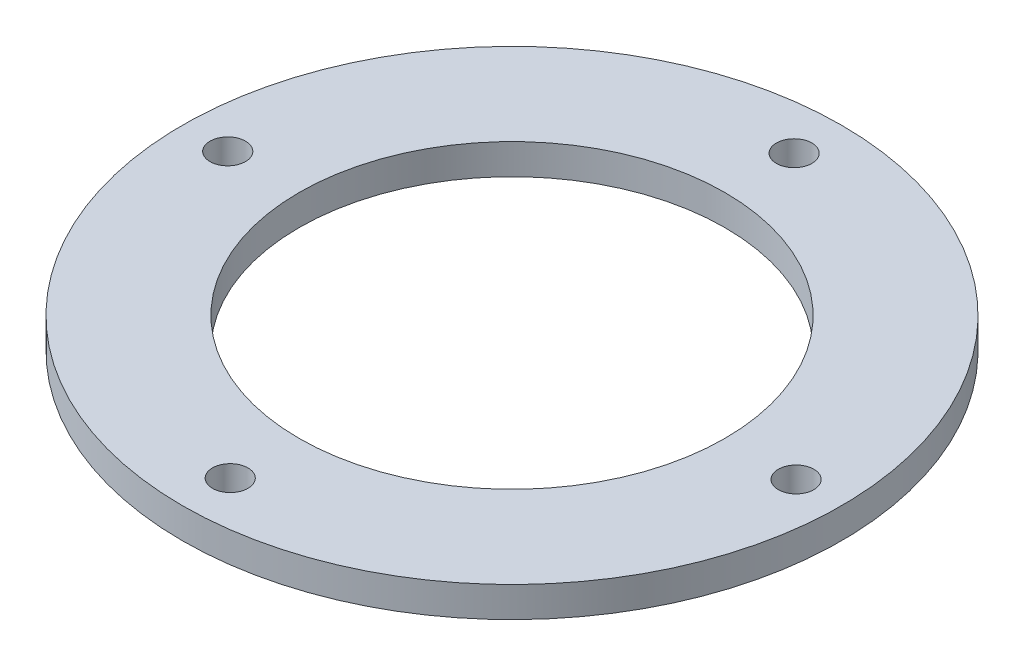
ISO-10303-21;
HEADER;
FILE_DESCRIPTION(('STEP AP214'),'2;1');
FILE_NAME('part.step','',(''),(''),'','','');
FILE_SCHEMA(('AUTOMOTIVE_DESIGN { 1 0 10303 214 1 1 1 1 }'));
ENDSEC;
DATA;
#1=APPLICATION_CONTEXT('core data for automotive mechanical design processes');
#2=APPLICATION_PROTOCOL_DEFINITION('international standard','automotive_design',2000,#1);
#3=PRODUCT_CONTEXT('',#1,'mechanical');
#4=PRODUCT('Part','Part','',(#3));
#5=PRODUCT_RELATED_PRODUCT_CATEGORY('part','',(#4));
#6=PRODUCT_DEFINITION_FORMATION('','',#4);
#7=PRODUCT_DEFINITION_CONTEXT('part definition',#1,'design');
#8=PRODUCT_DEFINITION('design','',#6,#7);
#9=PRODUCT_DEFINITION_SHAPE('','',#8);
#10=(LENGTH_UNIT() NAMED_UNIT(*) SI_UNIT(.MILLI.,.METRE.));
#11=(NAMED_UNIT(*) PLANE_ANGLE_UNIT() SI_UNIT($,.RADIAN.));
#12=(NAMED_UNIT(*) SI_UNIT($,.STERADIAN.) SOLID_ANGLE_UNIT());
#13=UNCERTAINTY_MEASURE_WITH_UNIT(LENGTH_MEASURE(1.E-05),#10,'distance_accuracy_value','');
#14=(GEOMETRIC_REPRESENTATION_CONTEXT(3) GLOBAL_UNCERTAINTY_ASSIGNED_CONTEXT((#13)) GLOBAL_UNIT_ASSIGNED_CONTEXT((#10,
#11,#12)) REPRESENTATION_CONTEXT('',''));
#15=CARTESIAN_POINT('',(0.,0.,0.));
#16=DIRECTION('',(0.,0.,1.));
#17=DIRECTION('',(1.,0.,0.));
#18=AXIS2_PLACEMENT_3D('',#15,#16,#17);
#19=CARTESIAN_POINT('',(0.,3.,0.));
#20=DIRECTION('',(0.,1.,0.));
#21=DIRECTION('',(0.,0.,1.));
#22=AXIS2_PLACEMENT_3D('',#19,#20,#21);
#23=PLANE('',#22);
#24=CARTESIAN_POINT('',(-28.0273872515695,3.,0.00397910375983372));
#25=DIRECTION('',(0.,1.,0.));
#26=DIRECTION('',(0.,0.,1.));
#27=AXIS2_PLACEMENT_3D('',#24,#25,#26);
#28=CIRCLE('',#27,1.75);
#29=CARTESIAN_POINT('',(-28.0273872515695,3.,1.75397910375983));
#30=VERTEX_POINT('',#29);
#31=EDGE_CURVE('E75',#30,#30,#28,.T.);
#32=ORIENTED_EDGE('',*,*,#31,.F.);
#33=EDGE_LOOP('',(#32));
#34=FACE_BOUND('',#33,.T.);
#35=CARTESIAN_POINT('',(28.0161930899202,3.,0.));
#36=DIRECTION('',(0.,1.,0.));
#37=DIRECTION('',(0.,0.,1.));
#38=AXIS2_PLACEMENT_3D('',#35,#36,#37);
#39=CIRCLE('',#38,1.75);
#40=CARTESIAN_POINT('',(28.0161930899202,3.,1.75));
#41=VERTEX_POINT('',#40);
#42=EDGE_CURVE('E79',#41,#41,#39,.T.);
#43=ORIENTED_EDGE('',*,*,#42,.F.);
#44=EDGE_LOOP('',(#43));
#45=FACE_BOUND('',#44,.T.);
#46=CARTESIAN_POINT('',(0.057759674881197,3.,-27.7662693975544));
#47=DIRECTION('',(0.,1.,0.));
#48=DIRECTION('',(0.,0.,1.));
#49=AXIS2_PLACEMENT_3D('',#46,#47,#48);
#50=CIRCLE('',#49,1.75);
#51=CARTESIAN_POINT('',(0.057759674881197,3.,-26.0162693975544));
#52=VERTEX_POINT('',#51);
#53=EDGE_CURVE('E67',#52,#52,#50,.T.);
#54=ORIENTED_EDGE('',*,*,#53,.F.);
#55=EDGE_LOOP('',(#54));
#56=FACE_BOUND('',#55,.T.);
#57=CARTESIAN_POINT('',(0.,3.,27.7888845354006));
#58=DIRECTION('',(0.,1.,0.));
#59=DIRECTION('',(0.,0.,1.));
#60=AXIS2_PLACEMENT_3D('',#57,#58,#59);
#61=CIRCLE('',#60,1.75);
#62=CARTESIAN_POINT('',(0.,3.,29.5388845354006));
#63=VERTEX_POINT('',#62);
#64=EDGE_CURVE('E56',#63,#63,#61,.T.);
#65=ORIENTED_EDGE('',*,*,#64,.F.);
#66=EDGE_LOOP('',(#65));
#67=FACE_BOUND('',#66,.T.);
#68=CARTESIAN_POINT('',(0.,3.,0.));
#69=DIRECTION('',(0.,1.,0.));
#70=DIRECTION('',(0.,0.,1.));
#71=AXIS2_PLACEMENT_3D('',#68,#69,#70);
#72=CIRCLE('',#71,32.5);
#73=CARTESIAN_POINT('',(0.,3.,32.5));
#74=VERTEX_POINT('',#73);
#75=EDGE_CURVE('E10',#74,#74,#72,.T.);
#76=ORIENTED_EDGE('',*,*,#75,.T.);
#77=EDGE_LOOP('',(#76));
#78=FACE_BOUND('',#77,.T.);
#79=CARTESIAN_POINT('',(0.,3.,0.));
#80=DIRECTION('',(0.,1.,0.));
#81=DIRECTION('',(0.,0.,1.));
#82=AXIS2_PLACEMENT_3D('',#79,#80,#81);
#83=CIRCLE('',#82,21.);
#84=CARTESIAN_POINT('',(0.,3.,21.));
#85=VERTEX_POINT('',#84);
#86=EDGE_CURVE('E50',#85,#85,#83,.T.);
#87=ORIENTED_EDGE('',*,*,#86,.F.);
#88=EDGE_LOOP('',(#87));
#89=FACE_BOUND('',#88,.T.);
#90=ADVANCED_FACE('F37',(#34,#45,#56,#67,#78,#89),#23,.T.);
#91=CARTESIAN_POINT('',(0.,0.,0.));
#92=DIRECTION('',(0.,1.,0.));
#93=DIRECTION('',(0.,0.,1.));
#94=AXIS2_PLACEMENT_3D('',#91,#92,#93);
#95=PLANE('',#94);
#96=CARTESIAN_POINT('',(-28.0273872515695,0.,0.00397910375983372));
#97=DIRECTION('',(0.,1.,0.));
#98=DIRECTION('',(0.,0.,1.));
#99=AXIS2_PLACEMENT_3D('',#96,#97,#98);
#100=CIRCLE('',#99,1.75);
#101=CARTESIAN_POINT('',(-28.0273872515695,0.,1.75397910375983));
#102=VERTEX_POINT('',#101);
#103=EDGE_CURVE('E83',#102,#102,#100,.T.);
#104=ORIENTED_EDGE('',*,*,#103,.T.);
#105=EDGE_LOOP('',(#104));
#106=FACE_BOUND('',#105,.T.);
#107=CARTESIAN_POINT('',(28.0161930899202,0.,0.));
#108=DIRECTION('',(0.,1.,0.));
#109=DIRECTION('',(0.,0.,1.));
#110=AXIS2_PLACEMENT_3D('',#107,#108,#109);
#111=CIRCLE('',#110,1.75);
#112=CARTESIAN_POINT('',(28.0161930899202,0.,1.75));
#113=VERTEX_POINT('',#112);
#114=EDGE_CURVE('E84',#113,#113,#111,.T.);
#115=ORIENTED_EDGE('',*,*,#114,.T.);
#116=EDGE_LOOP('',(#115));
#117=FACE_BOUND('',#116,.T.);
#118=CARTESIAN_POINT('',(0.057759674881197,0.,-27.7662693975544));
#119=DIRECTION('',(0.,1.,0.));
#120=DIRECTION('',(0.,0.,1.));
#121=AXIS2_PLACEMENT_3D('',#118,#119,#120);
#122=CIRCLE('',#121,1.75);
#123=CARTESIAN_POINT('',(0.057759674881197,0.,-26.0162693975544));
#124=VERTEX_POINT('',#123);
#125=EDGE_CURVE('E71',#124,#124,#122,.T.);
#126=ORIENTED_EDGE('',*,*,#125,.T.);
#127=EDGE_LOOP('',(#126));
#128=FACE_BOUND('',#127,.T.);
#129=CARTESIAN_POINT('',(0.,0.,27.7888845354006));
#130=DIRECTION('',(0.,1.,0.));
#131=DIRECTION('',(0.,0.,1.));
#132=AXIS2_PLACEMENT_3D('',#129,#130,#131);
#133=CIRCLE('',#132,1.75);
#134=CARTESIAN_POINT('',(0.,0.,29.5388845354006));
#135=VERTEX_POINT('',#134);
#136=EDGE_CURVE('E63',#135,#135,#133,.T.);
#137=ORIENTED_EDGE('',*,*,#136,.T.);
#138=EDGE_LOOP('',(#137));
#139=FACE_BOUND('',#138,.T.);
#140=CARTESIAN_POINT('',(0.,0.,0.));
#141=DIRECTION('',(0.,1.,0.));
#142=DIRECTION('',(0.,0.,1.));
#143=AXIS2_PLACEMENT_3D('',#140,#141,#142);
#144=CIRCLE('',#143,32.5);
#145=CARTESIAN_POINT('',(0.,0.,32.5));
#146=VERTEX_POINT('',#145);
#147=EDGE_CURVE('E41',#146,#146,#144,.T.);
#148=ORIENTED_EDGE('',*,*,#147,.F.);
#149=EDGE_LOOP('',(#148));
#150=FACE_BOUND('',#149,.T.);
#151=CARTESIAN_POINT('',(0.,0.,0.));
#152=DIRECTION('',(0.,1.,0.));
#153=DIRECTION('',(0.,0.,1.));
#154=AXIS2_PLACEMENT_3D('',#151,#152,#153);
#155=CIRCLE('',#154,21.);
#156=CARTESIAN_POINT('',(0.,0.,21.));
#157=VERTEX_POINT('',#156);
#158=EDGE_CURVE('E52',#157,#157,#155,.T.);
#159=ORIENTED_EDGE('',*,*,#158,.T.);
#160=EDGE_LOOP('',(#159));
#161=FACE_BOUND('',#160,.T.);
#162=ADVANCED_FACE('F92',(#106,#117,#128,#139,#150,#161),#95,.F.);
#163=CARTESIAN_POINT('',(0.,3.,0.));
#164=DIRECTION('',(0.,-1.,0.));
#165=DIRECTION('',(0.,0.,-1.));
#166=AXIS2_PLACEMENT_3D('',#163,#164,#165);
#167=CYLINDRICAL_SURFACE('',#166,32.5);
#168=ORIENTED_EDGE('',*,*,#75,.F.);
#169=EDGE_LOOP('',(#168));
#170=FACE_BOUND('',#169,.T.);
#171=ORIENTED_EDGE('',*,*,#147,.T.);
#172=EDGE_LOOP('',(#171));
#173=FACE_BOUND('',#172,.T.);
#174=ADVANCED_FACE('F39',(#170,#173),#167,.T.);
#175=CARTESIAN_POINT('',(0.,3.,0.));
#176=DIRECTION('',(0.,-1.,0.));
#177=DIRECTION('',(0.,0.,-1.));
#178=AXIS2_PLACEMENT_3D('',#175,#176,#177);
#179=CYLINDRICAL_SURFACE('',#178,21.);
#180=ORIENTED_EDGE('',*,*,#86,.T.);
#181=EDGE_LOOP('',(#180));
#182=FACE_BOUND('',#181,.T.);
#183=ORIENTED_EDGE('',*,*,#158,.F.);
#184=EDGE_LOOP('',(#183));
#185=FACE_BOUND('',#184,.T.);
#186=ADVANCED_FACE('F115',(#182,#185),#179,.F.);
#187=CARTESIAN_POINT('',(0.,0.,27.7888845354006));
#188=DIRECTION('',(0.,1.,0.));
#189=DIRECTION('',(0.,0.,1.));
#190=AXIS2_PLACEMENT_3D('',#187,#188,#189);
#191=CYLINDRICAL_SURFACE('',#190,1.75);
#192=ORIENTED_EDGE('',*,*,#64,.T.);
#193=EDGE_LOOP('',(#192));
#194=FACE_BOUND('',#193,.T.);
#195=ORIENTED_EDGE('',*,*,#136,.F.);
#196=EDGE_LOOP('',(#195));
#197=FACE_BOUND('',#196,.T.);
#198=ADVANCED_FACE('F118',(#194,#197),#191,.F.);
#199=CARTESIAN_POINT('',(0.057759674881197,0.,-27.7662693975544));
#200=DIRECTION('',(0.,1.,0.));
#201=DIRECTION('',(0.,0.,1.));
#202=AXIS2_PLACEMENT_3D('',#199,#200,#201);
#203=CYLINDRICAL_SURFACE('',#202,1.75);
#204=ORIENTED_EDGE('',*,*,#53,.T.);
#205=EDGE_LOOP('',(#204));
#206=FACE_BOUND('',#205,.T.);
#207=ORIENTED_EDGE('',*,*,#125,.F.);
#208=EDGE_LOOP('',(#207));
#209=FACE_BOUND('',#208,.T.);
#210=ADVANCED_FACE('F103',(#206,#209),#203,.F.);
#211=CARTESIAN_POINT('',(28.0161930899202,0.,0.));
#212=DIRECTION('',(0.,1.,0.));
#213=DIRECTION('',(0.,0.,1.));
#214=AXIS2_PLACEMENT_3D('',#211,#212,#213);
#215=CYLINDRICAL_SURFACE('',#214,1.75);
#216=ORIENTED_EDGE('',*,*,#42,.T.);
#217=EDGE_LOOP('',(#216));
#218=FACE_BOUND('',#217,.T.);
#219=ORIENTED_EDGE('',*,*,#114,.F.);
#220=EDGE_LOOP('',(#219));
#221=FACE_BOUND('',#220,.T.);
#222=ADVANCED_FACE('F97',(#218,#221),#215,.F.);
#223=CARTESIAN_POINT('',(-28.0273872515695,0.,0.00397910375983372));
#224=DIRECTION('',(0.,1.,0.));
#225=DIRECTION('',(0.,0.,1.));
#226=AXIS2_PLACEMENT_3D('',#223,#224,#225);
#227=CYLINDRICAL_SURFACE('',#226,1.75);
#228=ORIENTED_EDGE('',*,*,#31,.T.);
#229=EDGE_LOOP('',(#228));
#230=FACE_BOUND('',#229,.T.);
#231=ORIENTED_EDGE('',*,*,#103,.F.);
#232=EDGE_LOOP('',(#231));
#233=FACE_BOUND('',#232,.T.);
#234=ADVANCED_FACE('F95',(#230,#233),#227,.F.);
#235=CLOSED_SHELL('',(#90,#162,#174,#186,#198,#210,#222,#234));
#236=MANIFOLD_SOLID_BREP('B2',#235);
#237=ADVANCED_BREP_SHAPE_REPRESENTATION('',(#18,#236),#14);
#238=SHAPE_DEFINITION_REPRESENTATION(#9,#237);
ENDSEC;
END-ISO-10303-21;
